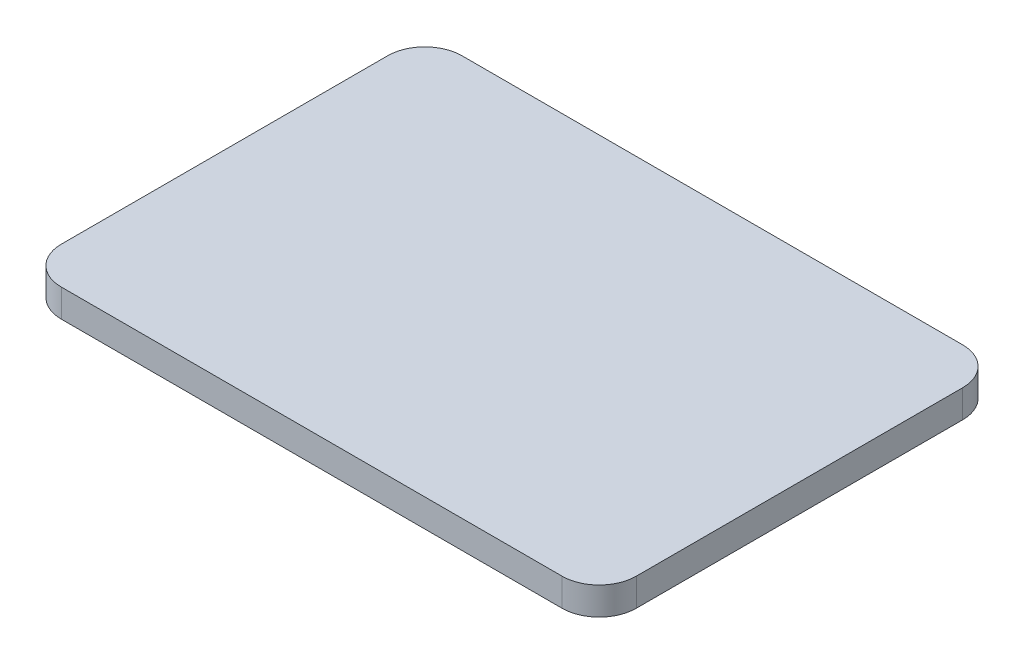
ISO-10303-21;
HEADER;
FILE_DESCRIPTION(('STEP AP214'),'2;1');
FILE_NAME('part.step','',(''),(''),'','','');
FILE_SCHEMA(('AUTOMOTIVE_DESIGN { 1 0 10303 214 1 1 1 1 }'));
ENDSEC;
DATA;
#1=APPLICATION_CONTEXT('core data for automotive mechanical design processes');
#2=APPLICATION_PROTOCOL_DEFINITION('international standard','automotive_design',2000,#1);
#3=PRODUCT_CONTEXT('',#1,'mechanical');
#4=PRODUCT('Part','Part','',(#3));
#5=PRODUCT_RELATED_PRODUCT_CATEGORY('part','',(#4));
#6=PRODUCT_DEFINITION_FORMATION('','',#4);
#7=PRODUCT_DEFINITION_CONTEXT('part definition',#1,'design');
#8=PRODUCT_DEFINITION('design','',#6,#7);
#9=PRODUCT_DEFINITION_SHAPE('','',#8);
#10=(LENGTH_UNIT() NAMED_UNIT(*) SI_UNIT(.MILLI.,.METRE.));
#11=(NAMED_UNIT(*) PLANE_ANGLE_UNIT() SI_UNIT($,.RADIAN.));
#12=(NAMED_UNIT(*) SI_UNIT($,.STERADIAN.) SOLID_ANGLE_UNIT());
#13=UNCERTAINTY_MEASURE_WITH_UNIT(LENGTH_MEASURE(1.E-05),#10,'distance_accuracy_value','');
#14=(GEOMETRIC_REPRESENTATION_CONTEXT(3) GLOBAL_UNCERTAINTY_ASSIGNED_CONTEXT((#13)) GLOBAL_UNIT_ASSIGNED_CONTEXT((#10,
#11,#12)) REPRESENTATION_CONTEXT('',''));
#15=CARTESIAN_POINT('',(0.,0.,0.));
#16=DIRECTION('',(0.,0.,1.));
#17=DIRECTION('',(1.,0.,0.));
#18=AXIS2_PLACEMENT_3D('',#15,#16,#17);
#19=CARTESIAN_POINT('',(-135.,15.,-88.));
#20=DIRECTION('',(0.,-1.,0.));
#21=DIRECTION('',(0.,0.,-1.));
#22=AXIS2_PLACEMENT_3D('',#19,#20,#21);
#23=CYLINDRICAL_SURFACE('',#22,20.);
#24=CARTESIAN_POINT('',(-135.,0.,-88.));
#25=DIRECTION('',(0.,1.,0.));
#26=DIRECTION('',(0.,0.,1.));
#27=AXIS2_PLACEMENT_3D('',#24,#25,#26);
#28=CIRCLE('',#27,20.);
#29=CARTESIAN_POINT('',(-135.,0.,-108.));
#30=VERTEX_POINT('',#29);
#31=CARTESIAN_POINT('',(-155.,0.,-88.));
#32=VERTEX_POINT('',#31);
#33=EDGE_CURVE('E131',#30,#32,#28,.T.);
#34=ORIENTED_EDGE('',*,*,#33,.T.);
#35=DIRECTION('',(0.,-1.,0.));
#36=VECTOR('',#35,1.);
#37=CARTESIAN_POINT('',(-155.,15.,-88.));
#38=LINE('',#37,#36);
#39=CARTESIAN_POINT('',(-155.,15.,-88.));
#40=VERTEX_POINT('',#39);
#41=EDGE_CURVE('E11',#40,#32,#38,.T.);
#42=ORIENTED_EDGE('',*,*,#41,.F.);
#43=CARTESIAN_POINT('',(-135.,15.,-88.));
#44=DIRECTION('',(0.,1.,0.));
#45=DIRECTION('',(0.,0.,1.));
#46=AXIS2_PLACEMENT_3D('',#43,#44,#45);
#47=CIRCLE('',#46,20.);
#48=CARTESIAN_POINT('',(-135.,15.,-108.));
#49=VERTEX_POINT('',#48);
#50=EDGE_CURVE('E145',#49,#40,#47,.T.);
#51=ORIENTED_EDGE('',*,*,#50,.F.);
#52=DIRECTION('',(0.,-1.,0.));
#53=VECTOR('',#52,1.);
#54=CARTESIAN_POINT('',(-135.,15.,-108.));
#55=LINE('',#54,#53);
#56=EDGE_CURVE('E127',#49,#30,#55,.T.);
#57=ORIENTED_EDGE('',*,*,#56,.T.);
#58=EDGE_LOOP('',(#34,#42,#51,#57));
#59=FACE_BOUND('',#58,.T.);
#60=ADVANCED_FACE('F35',(#59),#23,.T.);
#61=CARTESIAN_POINT('',(-155.,15.,-88.));
#62=DIRECTION('',(1.,0.,0.));
#63=DIRECTION('',(0.,0.,-1.));
#64=AXIS2_PLACEMENT_3D('',#61,#62,#63);
#65=PLANE('',#64);
#66=DIRECTION('',(0.,0.,1.));
#67=VECTOR('',#66,1.);
#68=CARTESIAN_POINT('',(-155.,0.,-88.));
#69=LINE('',#68,#67);
#70=CARTESIAN_POINT('',(-155.,0.,88.));
#71=VERTEX_POINT('',#70);
#72=EDGE_CURVE('E134',#32,#71,#69,.T.);
#73=ORIENTED_EDGE('',*,*,#72,.T.);
#74=DIRECTION('',(0.,-1.,0.));
#75=VECTOR('',#74,1.);
#76=CARTESIAN_POINT('',(-155.,15.,88.));
#77=LINE('',#76,#75);
#78=CARTESIAN_POINT('',(-155.,15.,88.));
#79=VERTEX_POINT('',#78);
#80=EDGE_CURVE('E43',#79,#71,#77,.T.);
#81=ORIENTED_EDGE('',*,*,#80,.F.);
#82=DIRECTION('',(0.,0.,1.));
#83=VECTOR('',#82,1.);
#84=CARTESIAN_POINT('',(-155.,15.,-88.));
#85=LINE('',#84,#83);
#86=EDGE_CURVE('E94',#40,#79,#85,.T.);
#87=ORIENTED_EDGE('',*,*,#86,.F.);
#88=ORIENTED_EDGE('',*,*,#41,.T.);
#89=EDGE_LOOP('',(#73,#81,#87,#88));
#90=FACE_BOUND('',#89,.T.);
#91=ADVANCED_FACE('F180',(#90),#65,.F.);
#92=CARTESIAN_POINT('',(-135.,15.,88.));
#93=DIRECTION('',(0.,-1.,0.));
#94=DIRECTION('',(0.,0.,-1.));
#95=AXIS2_PLACEMENT_3D('',#92,#93,#94);
#96=CYLINDRICAL_SURFACE('',#95,20.);
#97=CARTESIAN_POINT('',(-135.,0.,88.));
#98=DIRECTION('',(0.,1.,0.));
#99=DIRECTION('',(0.,0.,1.));
#100=AXIS2_PLACEMENT_3D('',#97,#98,#99);
#101=CIRCLE('',#100,20.);
#102=CARTESIAN_POINT('',(-135.,0.,108.));
#103=VERTEX_POINT('',#102);
#104=EDGE_CURVE('E136',#71,#103,#101,.T.);
#105=ORIENTED_EDGE('',*,*,#104,.T.);
#106=DIRECTION('',(0.,-1.,0.));
#107=VECTOR('',#106,1.);
#108=CARTESIAN_POINT('',(-135.,15.,108.));
#109=LINE('',#108,#107);
#110=CARTESIAN_POINT('',(-135.,15.,108.));
#111=VERTEX_POINT('',#110);
#112=EDGE_CURVE('E152',#111,#103,#109,.T.);
#113=ORIENTED_EDGE('',*,*,#112,.F.);
#114=CARTESIAN_POINT('',(-135.,15.,88.));
#115=DIRECTION('',(0.,1.,0.));
#116=DIRECTION('',(0.,0.,1.));
#117=AXIS2_PLACEMENT_3D('',#114,#115,#116);
#118=CIRCLE('',#117,20.);
#119=EDGE_CURVE('E160',#79,#111,#118,.T.);
#120=ORIENTED_EDGE('',*,*,#119,.F.);
#121=ORIENTED_EDGE('',*,*,#80,.T.);
#122=EDGE_LOOP('',(#105,#113,#120,#121));
#123=FACE_BOUND('',#122,.T.);
#124=ADVANCED_FACE('F158',(#123),#96,.T.);
#125=CARTESIAN_POINT('',(-135.,15.,108.));
#126=DIRECTION('',(0.,0.,-1.));
#127=DIRECTION('',(-1.,0.,0.));
#128=AXIS2_PLACEMENT_3D('',#125,#126,#127);
#129=PLANE('',#128);
#130=DIRECTION('',(1.,0.,0.));
#131=VECTOR('',#130,1.);
#132=CARTESIAN_POINT('',(-135.,0.,108.));
#133=LINE('',#132,#131);
#134=CARTESIAN_POINT('',(135.,0.,108.));
#135=VERTEX_POINT('',#134);
#136=EDGE_CURVE('E138',#103,#135,#133,.T.);
#137=ORIENTED_EDGE('',*,*,#136,.T.);
#138=DIRECTION('',(0.,-1.,0.));
#139=VECTOR('',#138,1.);
#140=CARTESIAN_POINT('',(135.,15.,108.));
#141=LINE('',#140,#139);
#142=CARTESIAN_POINT('',(135.,15.,108.));
#143=VERTEX_POINT('',#142);
#144=EDGE_CURVE('E149',#143,#135,#141,.T.);
#145=ORIENTED_EDGE('',*,*,#144,.F.);
#146=DIRECTION('',(1.,0.,0.));
#147=VECTOR('',#146,1.);
#148=CARTESIAN_POINT('',(-135.,15.,108.));
#149=LINE('',#148,#147);
#150=EDGE_CURVE('E172',#111,#143,#149,.T.);
#151=ORIENTED_EDGE('',*,*,#150,.F.);
#152=ORIENTED_EDGE('',*,*,#112,.T.);
#153=EDGE_LOOP('',(#137,#145,#151,#152));
#154=FACE_BOUND('',#153,.T.);
#155=ADVANCED_FACE('F168',(#154),#129,.F.);
#156=CARTESIAN_POINT('',(135.,15.,88.));
#157=DIRECTION('',(0.,-1.,0.));
#158=DIRECTION('',(0.,0.,-1.));
#159=AXIS2_PLACEMENT_3D('',#156,#157,#158);
#160=CYLINDRICAL_SURFACE('',#159,20.);
#161=CARTESIAN_POINT('',(135.,0.,88.));
#162=DIRECTION('',(0.,1.,0.));
#163=DIRECTION('',(0.,0.,1.));
#164=AXIS2_PLACEMENT_3D('',#161,#162,#163);
#165=CIRCLE('',#164,20.);
#166=CARTESIAN_POINT('',(155.,0.,88.));
#167=VERTEX_POINT('',#166);
#168=EDGE_CURVE('E140',#135,#167,#165,.T.);
#169=ORIENTED_EDGE('',*,*,#168,.T.);
#170=DIRECTION('',(0.,-1.,0.));
#171=VECTOR('',#170,1.);
#172=CARTESIAN_POINT('',(155.,15.,88.));
#173=LINE('',#172,#171);
#174=CARTESIAN_POINT('',(155.,15.,88.));
#175=VERTEX_POINT('',#174);
#176=EDGE_CURVE('E122',#175,#167,#173,.T.);
#177=ORIENTED_EDGE('',*,*,#176,.F.);
#178=CARTESIAN_POINT('',(135.,15.,88.));
#179=DIRECTION('',(0.,1.,0.));
#180=DIRECTION('',(0.,0.,1.));
#181=AXIS2_PLACEMENT_3D('',#178,#179,#180);
#182=CIRCLE('',#181,20.);
#183=EDGE_CURVE('E113',#143,#175,#182,.T.);
#184=ORIENTED_EDGE('',*,*,#183,.F.);
#185=ORIENTED_EDGE('',*,*,#144,.T.);
#186=EDGE_LOOP('',(#169,#177,#184,#185));
#187=FACE_BOUND('',#186,.T.);
#188=ADVANCED_FACE('F171',(#187),#160,.T.);
#189=CARTESIAN_POINT('',(155.,15.,-88.));
#190=DIRECTION('',(-1.,0.,0.));
#191=DIRECTION('',(0.,0.,1.));
#192=AXIS2_PLACEMENT_3D('',#189,#190,#191);
#193=PLANE('',#192);
#194=DIRECTION('',(0.,0.,-1.));
#195=VECTOR('',#194,1.);
#196=CARTESIAN_POINT('',(155.,0.,-88.));
#197=LINE('',#196,#195);
#198=CARTESIAN_POINT('',(155.,0.,-88.));
#199=VERTEX_POINT('',#198);
#200=EDGE_CURVE('E121',#167,#199,#197,.T.);
#201=ORIENTED_EDGE('',*,*,#200,.T.);
#202=DIRECTION('',(0.,-1.,0.));
#203=VECTOR('',#202,1.);
#204=CARTESIAN_POINT('',(155.,15.,-88.));
#205=LINE('',#204,#203);
#206=CARTESIAN_POINT('',(155.,15.,-88.));
#207=VERTEX_POINT('',#206);
#208=EDGE_CURVE('E118',#207,#199,#205,.T.);
#209=ORIENTED_EDGE('',*,*,#208,.F.);
#210=DIRECTION('',(0.,0.,-1.));
#211=VECTOR('',#210,1.);
#212=CARTESIAN_POINT('',(155.,15.,-88.));
#213=LINE('',#212,#211);
#214=EDGE_CURVE('E107',#175,#207,#213,.T.);
#215=ORIENTED_EDGE('',*,*,#214,.F.);
#216=ORIENTED_EDGE('',*,*,#176,.T.);
#217=EDGE_LOOP('',(#201,#209,#215,#216));
#218=FACE_BOUND('',#217,.T.);
#219=ADVANCED_FACE('F119',(#218),#193,.F.);
#220=CARTESIAN_POINT('',(135.,15.,-88.));
#221=DIRECTION('',(0.,-1.,0.));
#222=DIRECTION('',(0.,0.,-1.));
#223=AXIS2_PLACEMENT_3D('',#220,#221,#222);
#224=CYLINDRICAL_SURFACE('',#223,20.);
#225=CARTESIAN_POINT('',(135.,0.,-88.));
#226=DIRECTION('',(0.,1.,0.));
#227=DIRECTION('',(0.,0.,-1.));
#228=AXIS2_PLACEMENT_3D('',#225,#226,#227);
#229=CIRCLE('',#228,20.);
#230=CARTESIAN_POINT('',(135.,0.,-108.));
#231=VERTEX_POINT('',#230);
#232=EDGE_CURVE('E80',#199,#231,#229,.T.);
#233=ORIENTED_EDGE('',*,*,#232,.T.);
#234=DIRECTION('',(0.,-1.,0.));
#235=VECTOR('',#234,1.);
#236=CARTESIAN_POINT('',(135.,15.,-108.));
#237=LINE('',#236,#235);
#238=CARTESIAN_POINT('',(135.,15.,-108.));
#239=VERTEX_POINT('',#238);
#240=EDGE_CURVE('E123',#239,#231,#237,.T.);
#241=ORIENTED_EDGE('',*,*,#240,.F.);
#242=CARTESIAN_POINT('',(135.,15.,-88.));
#243=DIRECTION('',(0.,1.,0.));
#244=DIRECTION('',(0.,0.,-1.));
#245=AXIS2_PLACEMENT_3D('',#242,#243,#244);
#246=CIRCLE('',#245,20.);
#247=EDGE_CURVE('E111',#207,#239,#246,.T.);
#248=ORIENTED_EDGE('',*,*,#247,.F.);
#249=ORIENTED_EDGE('',*,*,#208,.T.);
#250=EDGE_LOOP('',(#233,#241,#248,#249));
#251=FACE_BOUND('',#250,.T.);
#252=ADVANCED_FACE('F125',(#251),#224,.T.);
#253=CARTESIAN_POINT('',(-135.,15.,-108.));
#254=DIRECTION('',(0.,0.,1.));
#255=DIRECTION('',(1.,0.,0.));
#256=AXIS2_PLACEMENT_3D('',#253,#254,#255);
#257=PLANE('',#256);
#258=DIRECTION('',(-1.,0.,0.));
#259=VECTOR('',#258,1.);
#260=CARTESIAN_POINT('',(-135.,0.,-108.));
#261=LINE('',#260,#259);
#262=EDGE_CURVE('E86',#231,#30,#261,.T.);
#263=ORIENTED_EDGE('',*,*,#262,.T.);
#264=ORIENTED_EDGE('',*,*,#56,.F.);
#265=DIRECTION('',(-1.,0.,0.));
#266=VECTOR('',#265,1.);
#267=CARTESIAN_POINT('',(-135.,15.,-108.));
#268=LINE('',#267,#266);
#269=EDGE_CURVE('E51',#239,#49,#268,.T.);
#270=ORIENTED_EDGE('',*,*,#269,.F.);
#271=ORIENTED_EDGE('',*,*,#240,.T.);
#272=EDGE_LOOP('',(#263,#264,#270,#271));
#273=FACE_BOUND('',#272,.T.);
#274=ADVANCED_FACE('F196',(#273),#257,.F.);
#275=CARTESIAN_POINT('',(-135.,15.,-88.));
#276=DIRECTION('',(0.,1.,0.));
#277=DIRECTION('',(0.,0.,1.));
#278=AXIS2_PLACEMENT_3D('',#275,#276,#277);
#279=PLANE('',#278);
#280=ORIENTED_EDGE('',*,*,#50,.T.);
#281=ORIENTED_EDGE('',*,*,#86,.T.);
#282=ORIENTED_EDGE('',*,*,#119,.T.);
#283=ORIENTED_EDGE('',*,*,#150,.T.);
#284=ORIENTED_EDGE('',*,*,#183,.T.);
#285=ORIENTED_EDGE('',*,*,#214,.T.);
#286=ORIENTED_EDGE('',*,*,#247,.T.);
#287=ORIENTED_EDGE('',*,*,#269,.T.);
#288=EDGE_LOOP('',(#280,#281,#282,#283,#284,#285,#286,#287));
#289=FACE_BOUND('',#288,.T.);
#290=ADVANCED_FACE('F109',(#289),#279,.T.);
#291=CARTESIAN_POINT('',(-135.,0.,-88.));
#292=DIRECTION('',(0.,1.,0.));
#293=DIRECTION('',(0.,0.,1.));
#294=AXIS2_PLACEMENT_3D('',#291,#292,#293);
#295=PLANE('',#294);
#296=ORIENTED_EDGE('',*,*,#33,.F.);
#297=ORIENTED_EDGE('',*,*,#262,.F.);
#298=ORIENTED_EDGE('',*,*,#232,.F.);
#299=ORIENTED_EDGE('',*,*,#200,.F.);
#300=ORIENTED_EDGE('',*,*,#168,.F.);
#301=ORIENTED_EDGE('',*,*,#136,.F.);
#302=ORIENTED_EDGE('',*,*,#104,.F.);
#303=ORIENTED_EDGE('',*,*,#72,.F.);
#304=EDGE_LOOP('',(#296,#297,#298,#299,#300,#301,#302,#303));
#305=FACE_BOUND('',#304,.T.);
#306=ADVANCED_FACE('F164',(#305),#295,.F.);
#307=CLOSED_SHELL('',(#60,#91,#124,#155,#188,#219,#252,#274,#290,#306));
#308=MANIFOLD_SOLID_BREP('B2',#307);
#309=ADVANCED_BREP_SHAPE_REPRESENTATION('',(#18,#308),#14);
#310=SHAPE_DEFINITION_REPRESENTATION(#9,#309);
ENDSEC;
END-ISO-10303-21;
